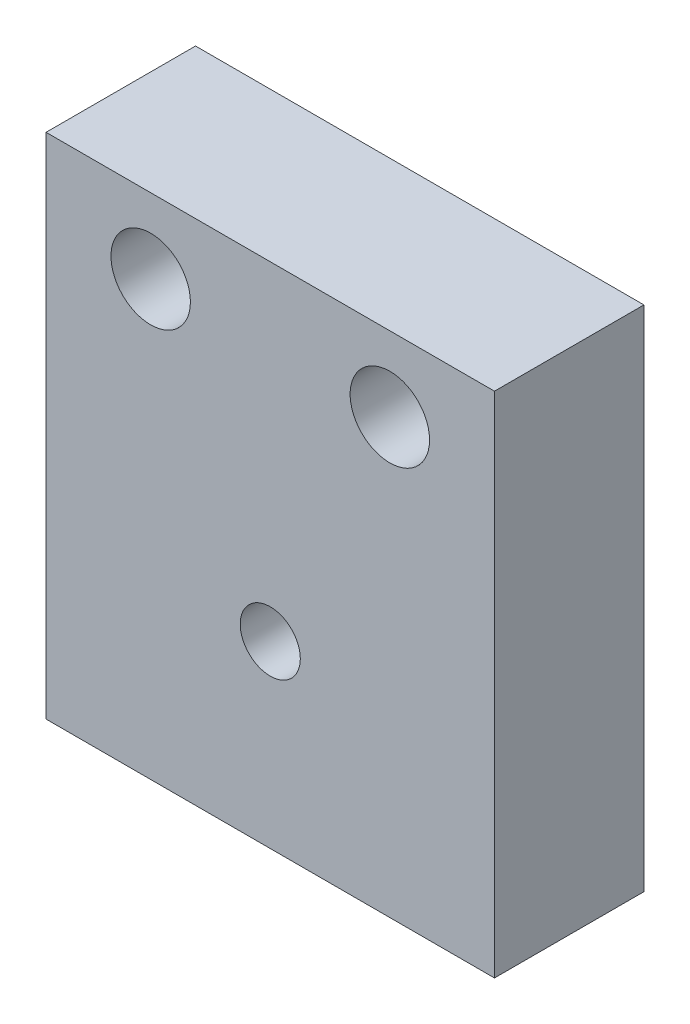
ISO-10303-21;
HEADER;
FILE_DESCRIPTION(('STEP AP214'),'2;1');
FILE_NAME('part.step','',(''),(''),'','','');
FILE_SCHEMA(('AUTOMOTIVE_DESIGN { 1 0 10303 214 1 1 1 1 }'));
ENDSEC;
DATA;
#1=APPLICATION_CONTEXT('core data for automotive mechanical design processes');
#2=APPLICATION_PROTOCOL_DEFINITION('international standard','automotive_design',2000,#1);
#3=PRODUCT_CONTEXT('',#1,'mechanical');
#4=PRODUCT('Part','Part','',(#3));
#5=PRODUCT_RELATED_PRODUCT_CATEGORY('part','',(#4));
#6=PRODUCT_DEFINITION_FORMATION('','',#4);
#7=PRODUCT_DEFINITION_CONTEXT('part definition',#1,'design');
#8=PRODUCT_DEFINITION('design','',#6,#7);
#9=PRODUCT_DEFINITION_SHAPE('','',#8);
#10=(LENGTH_UNIT() NAMED_UNIT(*) SI_UNIT(.MILLI.,.METRE.));
#11=(NAMED_UNIT(*) PLANE_ANGLE_UNIT() SI_UNIT($,.RADIAN.));
#12=(NAMED_UNIT(*) SI_UNIT($,.STERADIAN.) SOLID_ANGLE_UNIT());
#13=UNCERTAINTY_MEASURE_WITH_UNIT(LENGTH_MEASURE(1.E-05),#10,'distance_accuracy_value','');
#14=(GEOMETRIC_REPRESENTATION_CONTEXT(3) GLOBAL_UNCERTAINTY_ASSIGNED_CONTEXT((#13)) GLOBAL_UNIT_ASSIGNED_CONTEXT((#10,
#11,#12)) REPRESENTATION_CONTEXT('',''));
#15=CARTESIAN_POINT('',(0.,0.,0.));
#16=DIRECTION('',(0.,0.,1.));
#17=DIRECTION('',(1.,0.,0.));
#18=AXIS2_PLACEMENT_3D('',#15,#16,#17);
#19=CARTESIAN_POINT('',(0.,0.,-12.7));
#20=DIRECTION('',(-1.,0.,0.));
#21=DIRECTION('',(0.,0.,1.));
#22=AXIS2_PLACEMENT_3D('',#19,#20,#21);
#23=PLANE('',#22);
#24=DIRECTION('',(0.,-1.,0.));
#25=VECTOR('',#24,1.);
#26=CARTESIAN_POINT('',(0.,0.,0.));
#27=LINE('',#26,#25);
#28=CARTESIAN_POINT('',(0.,43.18,0.));
#29=VERTEX_POINT('',#28);
#30=CARTESIAN_POINT('',(0.,0.,0.));
#31=VERTEX_POINT('',#30);
#32=EDGE_CURVE('E112',#29,#31,#27,.T.);
#33=ORIENTED_EDGE('',*,*,#32,.F.);
#34=DIRECTION('',(0.,0.,1.));
#35=VECTOR('',#34,1.);
#36=CARTESIAN_POINT('',(0.,43.18,-12.7));
#37=LINE('',#36,#35);
#38=CARTESIAN_POINT('',(0.,43.18,-12.7));
#39=VERTEX_POINT('',#38);
#40=EDGE_CURVE('E11',#39,#29,#37,.T.);
#41=ORIENTED_EDGE('',*,*,#40,.F.);
#42=DIRECTION('',(0.,-1.,0.));
#43=VECTOR('',#42,1.);
#44=CARTESIAN_POINT('',(0.,0.,-12.7));
#45=LINE('',#44,#43);
#46=CARTESIAN_POINT('',(0.,0.,-12.7));
#47=VERTEX_POINT('',#46);
#48=EDGE_CURVE('E103',#39,#47,#45,.T.);
#49=ORIENTED_EDGE('',*,*,#48,.T.);
#50=DIRECTION('',(0.,0.,1.));
#51=VECTOR('',#50,1.);
#52=CARTESIAN_POINT('',(0.,0.,-12.7));
#53=LINE('',#52,#51);
#54=EDGE_CURVE('E44',#47,#31,#53,.T.);
#55=ORIENTED_EDGE('',*,*,#54,.T.);
#56=EDGE_LOOP('',(#33,#41,#49,#55));
#57=FACE_BOUND('',#56,.T.);
#58=ADVANCED_FACE('F41',(#57),#23,.T.);
#59=CARTESIAN_POINT('',(0.,43.18,-12.7));
#60=DIRECTION('',(0.,1.,0.));
#61=DIRECTION('',(0.,0.,1.));
#62=AXIS2_PLACEMENT_3D('',#59,#60,#61);
#63=PLANE('',#62);
#64=DIRECTION('',(-1.,0.,0.));
#65=VECTOR('',#64,1.);
#66=CARTESIAN_POINT('',(0.,43.18,0.));
#67=LINE('',#66,#65);
#68=CARTESIAN_POINT('',(38.1,43.18,0.));
#69=VERTEX_POINT('',#68);
#70=EDGE_CURVE('E106',#69,#29,#67,.T.);
#71=ORIENTED_EDGE('',*,*,#70,.F.);
#72=DIRECTION('',(0.,0.,1.));
#73=VECTOR('',#72,1.);
#74=CARTESIAN_POINT('',(38.1,43.18,-12.7));
#75=LINE('',#74,#73);
#76=CARTESIAN_POINT('',(38.1,43.18,-12.7));
#77=VERTEX_POINT('',#76);
#78=EDGE_CURVE('E51',#77,#69,#75,.T.);
#79=ORIENTED_EDGE('',*,*,#78,.F.);
#80=DIRECTION('',(-1.,0.,0.));
#81=VECTOR('',#80,1.);
#82=CARTESIAN_POINT('',(0.,43.18,-12.7));
#83=LINE('',#82,#81);
#84=EDGE_CURVE('E98',#77,#39,#83,.T.);
#85=ORIENTED_EDGE('',*,*,#84,.T.);
#86=ORIENTED_EDGE('',*,*,#40,.T.);
#87=EDGE_LOOP('',(#71,#79,#85,#86));
#88=FACE_BOUND('',#87,.T.);
#89=ADVANCED_FACE('F129',(#88),#63,.T.);
#90=CARTESIAN_POINT('',(38.1,0.,-12.7));
#91=DIRECTION('',(1.,0.,0.));
#92=DIRECTION('',(0.,0.,-1.));
#93=AXIS2_PLACEMENT_3D('',#90,#91,#92);
#94=PLANE('',#93);
#95=DIRECTION('',(0.,1.,0.));
#96=VECTOR('',#95,1.);
#97=CARTESIAN_POINT('',(38.1,0.,0.));
#98=LINE('',#97,#96);
#99=CARTESIAN_POINT('',(38.1,0.,0.));
#100=VERTEX_POINT('',#99);
#101=EDGE_CURVE('E92',#100,#69,#98,.T.);
#102=ORIENTED_EDGE('',*,*,#101,.F.);
#103=DIRECTION('',(0.,0.,1.));
#104=VECTOR('',#103,1.);
#105=CARTESIAN_POINT('',(38.1,0.,-12.7));
#106=LINE('',#105,#104);
#107=CARTESIAN_POINT('',(38.1,0.,-12.7));
#108=VERTEX_POINT('',#107);
#109=EDGE_CURVE('E87',#108,#100,#106,.T.);
#110=ORIENTED_EDGE('',*,*,#109,.F.);
#111=DIRECTION('',(0.,1.,0.));
#112=VECTOR('',#111,1.);
#113=CARTESIAN_POINT('',(38.1,0.,-12.7));
#114=LINE('',#113,#112);
#115=EDGE_CURVE('E90',#108,#77,#114,.T.);
#116=ORIENTED_EDGE('',*,*,#115,.T.);
#117=ORIENTED_EDGE('',*,*,#78,.T.);
#118=EDGE_LOOP('',(#102,#110,#116,#117));
#119=FACE_BOUND('',#118,.T.);
#120=ADVANCED_FACE('F89',(#119),#94,.T.);
#121=CARTESIAN_POINT('',(0.,0.,-12.7));
#122=DIRECTION('',(0.,-1.,0.));
#123=DIRECTION('',(0.,0.,-1.));
#124=AXIS2_PLACEMENT_3D('',#121,#122,#123);
#125=PLANE('',#124);
#126=DIRECTION('',(1.,0.,0.));
#127=VECTOR('',#126,1.);
#128=CARTESIAN_POINT('',(0.,0.,0.));
#129=LINE('',#128,#127);
#130=EDGE_CURVE('E116',#31,#100,#129,.T.);
#131=ORIENTED_EDGE('',*,*,#130,.F.);
#132=ORIENTED_EDGE('',*,*,#54,.F.);
#133=DIRECTION('',(1.,0.,0.));
#134=VECTOR('',#133,1.);
#135=CARTESIAN_POINT('',(0.,0.,-12.7));
#136=LINE('',#135,#134);
#137=EDGE_CURVE('E97',#47,#108,#136,.T.);
#138=ORIENTED_EDGE('',*,*,#137,.T.);
#139=ORIENTED_EDGE('',*,*,#109,.T.);
#140=EDGE_LOOP('',(#131,#132,#138,#139));
#141=FACE_BOUND('',#140,.T.);
#142=ADVANCED_FACE('F101',(#141),#125,.T.);
#143=CARTESIAN_POINT('',(0.,0.,-12.7));
#144=DIRECTION('',(0.,0.,-1.));
#145=DIRECTION('',(-1.,0.,0.));
#146=AXIS2_PLACEMENT_3D('',#143,#144,#145);
#147=PLANE('',#146);
#148=CARTESIAN_POINT('',(19.05,15.24,-12.7));
#149=DIRECTION('',(0.,0.,-1.));
#150=DIRECTION('',(-1.,0.,0.));
#151=AXIS2_PLACEMENT_3D('',#148,#149,#150);
#152=CIRCLE('',#151,2.55269999999999);
#153=CARTESIAN_POINT('',(16.4973,15.24,-12.7));
#154=VERTEX_POINT('',#153);
#155=EDGE_CURVE('E169',#154,#154,#152,.T.);
#156=ORIENTED_EDGE('',*,*,#155,.F.);
#157=EDGE_LOOP('',(#156));
#158=FACE_BOUND('',#157,.T.);
#159=CARTESIAN_POINT('',(29.21,36.83,-12.7));
#160=DIRECTION('',(0.,0.,1.));
#161=DIRECTION('',(1.,0.,0.));
#162=AXIS2_PLACEMENT_3D('',#159,#160,#161);
#163=CIRCLE('',#162,3.37350099999999);
#164=CARTESIAN_POINT('',(32.583501,36.83,-12.7));
#165=VERTEX_POINT('',#164);
#166=EDGE_CURVE('E176',#165,#165,#163,.T.);
#167=ORIENTED_EDGE('',*,*,#166,.T.);
#168=EDGE_LOOP('',(#167));
#169=FACE_BOUND('',#168,.T.);
#170=CARTESIAN_POINT('',(8.89,36.83,-12.7));
#171=DIRECTION('',(0.,0.,1.));
#172=DIRECTION('',(1.,0.,0.));
#173=AXIS2_PLACEMENT_3D('',#170,#171,#172);
#174=CIRCLE('',#173,3.373501);
#175=CARTESIAN_POINT('',(12.263501,36.83,-12.7));
#176=VERTEX_POINT('',#175);
#177=EDGE_CURVE('E117',#176,#176,#174,.T.);
#178=ORIENTED_EDGE('',*,*,#177,.T.);
#179=EDGE_LOOP('',(#178));
#180=FACE_BOUND('',#179,.T.);
#181=ORIENTED_EDGE('',*,*,#48,.F.);
#182=ORIENTED_EDGE('',*,*,#84,.F.);
#183=ORIENTED_EDGE('',*,*,#115,.F.);
#184=ORIENTED_EDGE('',*,*,#137,.F.);
#185=EDGE_LOOP('',(#181,#182,#183,#184));
#186=FACE_BOUND('',#185,.T.);
#187=ADVANCED_FACE('F96',(#158,#169,#180,#186),#147,.T.);
#188=CARTESIAN_POINT('',(0.,0.,0.));
#189=DIRECTION('',(0.,0.,-1.));
#190=DIRECTION('',(-1.,0.,0.));
#191=AXIS2_PLACEMENT_3D('',#188,#189,#190);
#192=PLANE('',#191);
#193=CARTESIAN_POINT('',(19.05,15.24,0.));
#194=DIRECTION('',(0.,0.,1.));
#195=DIRECTION('',(1.,0.,0.));
#196=AXIS2_PLACEMENT_3D('',#193,#194,#195);
#197=CIRCLE('',#196,2.55269999999999);
#198=CARTESIAN_POINT('',(21.6027,15.24,0.));
#199=VERTEX_POINT('',#198);
#200=EDGE_CURVE('E167',#199,#199,#197,.T.);
#201=ORIENTED_EDGE('',*,*,#200,.F.);
#202=EDGE_LOOP('',(#201));
#203=FACE_BOUND('',#202,.T.);
#204=CARTESIAN_POINT('',(29.21,36.83,0.));
#205=DIRECTION('',(0.,0.,1.));
#206=DIRECTION('',(1.,0.,0.));
#207=AXIS2_PLACEMENT_3D('',#204,#205,#206);
#208=CIRCLE('',#207,3.373501);
#209=CARTESIAN_POINT('',(32.583501,36.83,0.));
#210=VERTEX_POINT('',#209);
#211=EDGE_CURVE('E171',#210,#210,#208,.T.);
#212=ORIENTED_EDGE('',*,*,#211,.F.);
#213=EDGE_LOOP('',(#212));
#214=FACE_BOUND('',#213,.T.);
#215=CARTESIAN_POINT('',(8.89,36.83,0.));
#216=DIRECTION('',(0.,0.,1.));
#217=DIRECTION('',(1.,0.,0.));
#218=AXIS2_PLACEMENT_3D('',#215,#216,#217);
#219=CIRCLE('',#218,3.373501);
#220=CARTESIAN_POINT('',(12.263501,36.83,0.));
#221=VERTEX_POINT('',#220);
#222=EDGE_CURVE('E183',#221,#221,#219,.T.);
#223=ORIENTED_EDGE('',*,*,#222,.F.);
#224=EDGE_LOOP('',(#223));
#225=FACE_BOUND('',#224,.T.);
#226=ORIENTED_EDGE('',*,*,#32,.T.);
#227=ORIENTED_EDGE('',*,*,#130,.T.);
#228=ORIENTED_EDGE('',*,*,#101,.T.);
#229=ORIENTED_EDGE('',*,*,#70,.T.);
#230=EDGE_LOOP('',(#226,#227,#228,#229));
#231=FACE_BOUND('',#230,.T.);
#232=ADVANCED_FACE('F128',(#203,#214,#225,#231),#192,.F.);
#233=CARTESIAN_POINT('',(8.89,36.83,0.));
#234=DIRECTION('',(0.,0.,1.));
#235=DIRECTION('',(1.,0.,0.));
#236=AXIS2_PLACEMENT_3D('',#233,#234,#235);
#237=CYLINDRICAL_SURFACE('',#236,3.373501);
#238=ORIENTED_EDGE('',*,*,#177,.F.);
#239=EDGE_LOOP('',(#238));
#240=FACE_BOUND('',#239,.T.);
#241=ORIENTED_EDGE('',*,*,#222,.T.);
#242=EDGE_LOOP('',(#241));
#243=FACE_BOUND('',#242,.T.);
#244=ADVANCED_FACE('F147',(#240,#243),#237,.F.);
#245=CARTESIAN_POINT('',(29.21,36.83,0.));
#246=DIRECTION('',(0.,0.,1.));
#247=DIRECTION('',(1.,0.,0.));
#248=AXIS2_PLACEMENT_3D('',#245,#246,#247);
#249=CYLINDRICAL_SURFACE('',#248,3.373501);
#250=ORIENTED_EDGE('',*,*,#166,.F.);
#251=EDGE_LOOP('',(#250));
#252=FACE_BOUND('',#251,.T.);
#253=ORIENTED_EDGE('',*,*,#211,.T.);
#254=EDGE_LOOP('',(#253));
#255=FACE_BOUND('',#254,.T.);
#256=ADVANCED_FACE('F154',(#252,#255),#249,.F.);
#257=CARTESIAN_POINT('',(19.05,15.24,0.));
#258=DIRECTION('',(0.,0.,1.));
#259=DIRECTION('',(1.,0.,0.));
#260=AXIS2_PLACEMENT_3D('',#257,#258,#259);
#261=CYLINDRICAL_SURFACE('',#260,2.55269999999999);
#262=ORIENTED_EDGE('',*,*,#200,.T.);
#263=EDGE_LOOP('',(#262));
#264=FACE_BOUND('',#263,.T.);
#265=ORIENTED_EDGE('',*,*,#155,.T.);
#266=EDGE_LOOP('',(#265));
#267=FACE_BOUND('',#266,.T.);
#268=ADVANCED_FACE('F158',(#264,#267),#261,.F.);
#269=CLOSED_SHELL('',(#58,#89,#120,#142,#187,#232,#244,#256,#268));
#270=MANIFOLD_SOLID_BREP('B2',#269);
#271=ADVANCED_BREP_SHAPE_REPRESENTATION('',(#18,#270),#14);
#272=SHAPE_DEFINITION_REPRESENTATION(#9,#271);
ENDSEC;
END-ISO-10303-21;
